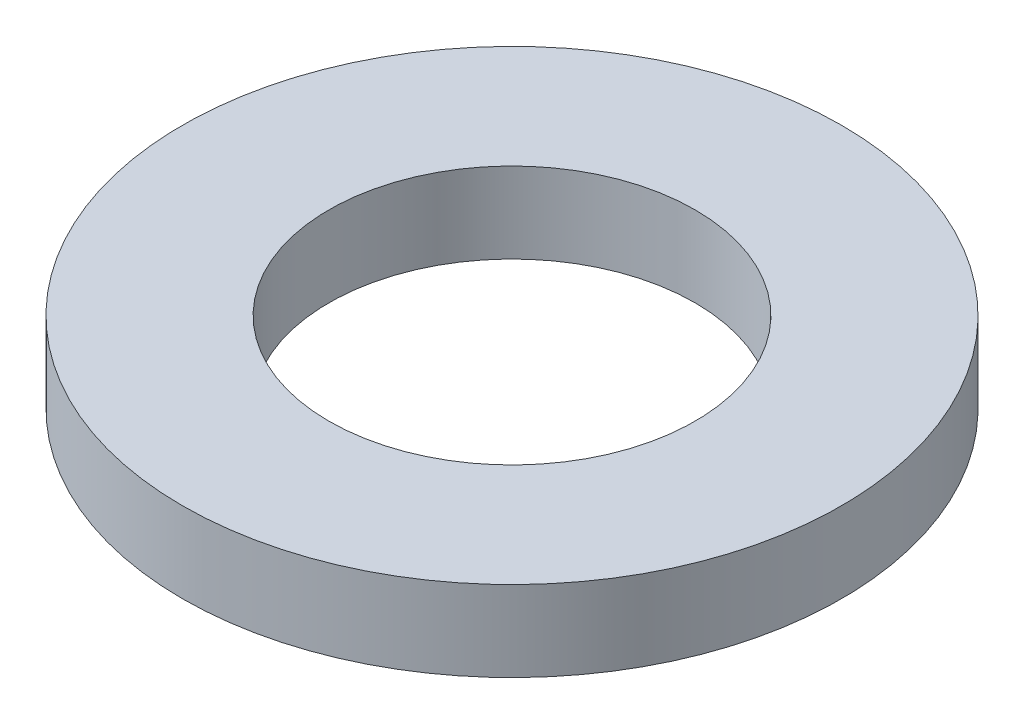
ISO-10303-21;
HEADER;
FILE_DESCRIPTION(('STEP AP214'),'2;1');
FILE_NAME('part.step','',(''),(''),'','','');
FILE_SCHEMA(('AUTOMOTIVE_DESIGN { 1 0 10303 214 1 1 1 1 }'));
ENDSEC;
DATA;
#1=APPLICATION_CONTEXT('core data for automotive mechanical design processes');
#2=APPLICATION_PROTOCOL_DEFINITION('international standard','automotive_design',2000,#1);
#3=PRODUCT_CONTEXT('',#1,'mechanical');
#4=PRODUCT('Part','Part','',(#3));
#5=PRODUCT_RELATED_PRODUCT_CATEGORY('part','',(#4));
#6=PRODUCT_DEFINITION_FORMATION('','',#4);
#7=PRODUCT_DEFINITION_CONTEXT('part definition',#1,'design');
#8=PRODUCT_DEFINITION('design','',#6,#7);
#9=PRODUCT_DEFINITION_SHAPE('','',#8);
#10=(LENGTH_UNIT() NAMED_UNIT(*) SI_UNIT(.MILLI.,.METRE.));
#11=(NAMED_UNIT(*) PLANE_ANGLE_UNIT() SI_UNIT($,.RADIAN.));
#12=(NAMED_UNIT(*) SI_UNIT($,.STERADIAN.) SOLID_ANGLE_UNIT());
#13=UNCERTAINTY_MEASURE_WITH_UNIT(LENGTH_MEASURE(1.E-05),#10,'distance_accuracy_value','');
#14=(GEOMETRIC_REPRESENTATION_CONTEXT(3) GLOBAL_UNCERTAINTY_ASSIGNED_CONTEXT((#13)) GLOBAL_UNIT_ASSIGNED_CONTEXT((#10,
#11,#12)) REPRESENTATION_CONTEXT('',''));
#15=CARTESIAN_POINT('',(0.,0.,0.));
#16=DIRECTION('',(0.,0.,1.));
#17=DIRECTION('',(1.,0.,0.));
#18=AXIS2_PLACEMENT_3D('',#15,#16,#17);
#19=CARTESIAN_POINT('',(0.,22.,0.));
#20=DIRECTION('',(0.,-1.,0.));
#21=DIRECTION('',(0.,0.,-1.));
#22=AXIS2_PLACEMENT_3D('',#19,#20,#21);
#23=CYLINDRICAL_SURFACE('',#22,90.);
#24=CARTESIAN_POINT('',(0.,22.,0.));
#25=DIRECTION('',(0.,1.,0.));
#26=DIRECTION('',(0.,0.,1.));
#27=AXIS2_PLACEMENT_3D('',#24,#25,#26);
#28=CIRCLE('',#27,90.);
#29=CARTESIAN_POINT('',(0.,22.,90.));
#30=VERTEX_POINT('',#29);
#31=EDGE_CURVE('E10',#30,#30,#28,.T.);
#32=ORIENTED_EDGE('',*,*,#31,.F.);
#33=EDGE_LOOP('',(#32));
#34=FACE_BOUND('',#33,.T.);
#35=CARTESIAN_POINT('',(0.,0.,0.));
#36=DIRECTION('',(0.,1.,0.));
#37=DIRECTION('',(0.,0.,1.));
#38=AXIS2_PLACEMENT_3D('',#35,#36,#37);
#39=CIRCLE('',#38,90.);
#40=CARTESIAN_POINT('',(0.,0.,90.));
#41=VERTEX_POINT('',#40);
#42=EDGE_CURVE('E37',#41,#41,#39,.T.);
#43=ORIENTED_EDGE('',*,*,#42,.T.);
#44=EDGE_LOOP('',(#43));
#45=FACE_BOUND('',#44,.T.);
#46=ADVANCED_FACE('F40',(#34,#45),#23,.T.);
#47=CARTESIAN_POINT('',(0.,22.,0.));
#48=DIRECTION('',(0.,1.,0.));
#49=DIRECTION('',(0.,0.,1.));
#50=AXIS2_PLACEMENT_3D('',#47,#48,#49);
#51=PLANE('',#50);
#52=CARTESIAN_POINT('',(0.,22.,0.));
#53=DIRECTION('',(0.,1.,0.));
#54=DIRECTION('',(0.,0.,1.));
#55=AXIS2_PLACEMENT_3D('',#52,#53,#54);
#56=CIRCLE('',#55,50.);
#57=CARTESIAN_POINT('',(0.,22.,50.));
#58=VERTEX_POINT('',#57);
#59=EDGE_CURVE('E50',#58,#58,#56,.T.);
#60=ORIENTED_EDGE('',*,*,#59,.F.);
#61=EDGE_LOOP('',(#60));
#62=FACE_BOUND('',#61,.T.);
#63=ORIENTED_EDGE('',*,*,#31,.T.);
#64=EDGE_LOOP('',(#63));
#65=FACE_BOUND('',#64,.T.);
#66=ADVANCED_FACE('F59',(#62,#65),#51,.T.);
#67=CARTESIAN_POINT('',(0.,0.,0.));
#68=DIRECTION('',(0.,1.,0.));
#69=DIRECTION('',(0.,0.,1.));
#70=AXIS2_PLACEMENT_3D('',#67,#68,#69);
#71=PLANE('',#70);
#72=CARTESIAN_POINT('',(0.,0.,0.));
#73=DIRECTION('',(0.,1.,0.));
#74=DIRECTION('',(0.,0.,1.));
#75=AXIS2_PLACEMENT_3D('',#72,#73,#74);
#76=CIRCLE('',#75,50.);
#77=CARTESIAN_POINT('',(0.,0.,50.));
#78=VERTEX_POINT('',#77);
#79=EDGE_CURVE('E47',#78,#78,#76,.T.);
#80=ORIENTED_EDGE('',*,*,#79,.T.);
#81=EDGE_LOOP('',(#80));
#82=FACE_BOUND('',#81,.T.);
#83=ORIENTED_EDGE('',*,*,#42,.F.);
#84=EDGE_LOOP('',(#83));
#85=FACE_BOUND('',#84,.T.);
#86=ADVANCED_FACE('F58',(#82,#85),#71,.F.);
#87=CARTESIAN_POINT('',(0.,22.,0.));
#88=DIRECTION('',(0.,-1.,0.));
#89=DIRECTION('',(0.,0.,-1.));
#90=AXIS2_PLACEMENT_3D('',#87,#88,#89);
#91=CYLINDRICAL_SURFACE('',#90,50.);
#92=ORIENTED_EDGE('',*,*,#59,.T.);
#93=EDGE_LOOP('',(#92));
#94=FACE_BOUND('',#93,.T.);
#95=ORIENTED_EDGE('',*,*,#79,.F.);
#96=EDGE_LOOP('',(#95));
#97=FACE_BOUND('',#96,.T.);
#98=ADVANCED_FACE('F54',(#94,#97),#91,.F.);
#99=CLOSED_SHELL('',(#46,#66,#86,#98));
#100=MANIFOLD_SOLID_BREP('B2',#99);
#101=ADVANCED_BREP_SHAPE_REPRESENTATION('',(#18,#100),#14);
#102=SHAPE_DEFINITION_REPRESENTATION(#9,#101);
ENDSEC;
END-ISO-10303-21;
